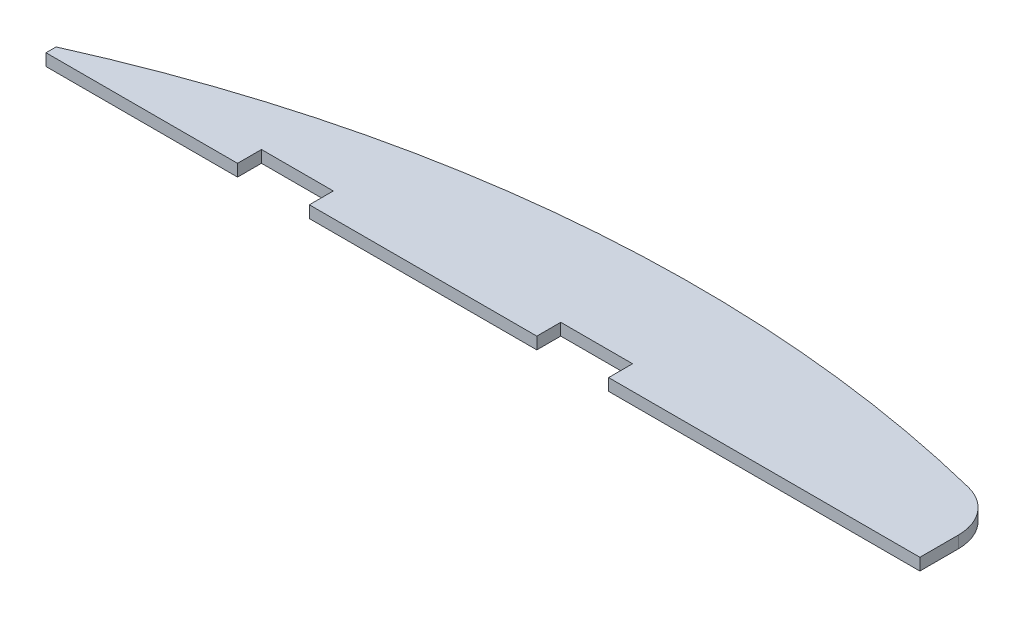
ISO-10303-21;
HEADER;
FILE_DESCRIPTION(('STEP AP214'),'2;1');
FILE_NAME('part.step','',(''),(''),'','','');
FILE_SCHEMA(('AUTOMOTIVE_DESIGN { 1 0 10303 214 1 1 1 1 }'));
ENDSEC;
DATA;
#1=APPLICATION_CONTEXT('core data for automotive mechanical design processes');
#2=APPLICATION_PROTOCOL_DEFINITION('international standard','automotive_design',2000,#1);
#3=PRODUCT_CONTEXT('',#1,'mechanical');
#4=PRODUCT('Part','Part','',(#3));
#5=PRODUCT_RELATED_PRODUCT_CATEGORY('part','',(#4));
#6=PRODUCT_DEFINITION_FORMATION('','',#4);
#7=PRODUCT_DEFINITION_CONTEXT('part definition',#1,'design');
#8=PRODUCT_DEFINITION('design','',#6,#7);
#9=PRODUCT_DEFINITION_SHAPE('','',#8);
#10=(LENGTH_UNIT() NAMED_UNIT(*) SI_UNIT(.MILLI.,.METRE.));
#11=(NAMED_UNIT(*) PLANE_ANGLE_UNIT() SI_UNIT($,.RADIAN.));
#12=(NAMED_UNIT(*) SI_UNIT($,.STERADIAN.) SOLID_ANGLE_UNIT());
#13=UNCERTAINTY_MEASURE_WITH_UNIT(LENGTH_MEASURE(1.E-05),#10,'distance_accuracy_value','');
#14=(GEOMETRIC_REPRESENTATION_CONTEXT(3) GLOBAL_UNCERTAINTY_ASSIGNED_CONTEXT((#13)) GLOBAL_UNIT_ASSIGNED_CONTEXT((#10,
#11,#12)) REPRESENTATION_CONTEXT('',''));
#15=CARTESIAN_POINT('',(0.,0.,0.));
#16=DIRECTION('',(0.,0.,1.));
#17=DIRECTION('',(1.,0.,0.));
#18=AXIS2_PLACEMENT_3D('',#15,#16,#17);
#19=CARTESIAN_POINT('',(-30.,1.,3.));
#20=DIRECTION('',(0.,0.,-1.));
#21=DIRECTION('',(-1.,0.,0.));
#22=AXIS2_PLACEMENT_3D('',#19,#20,#21);
#23=PLANE('',#22);
#24=DIRECTION('',(1.,0.,0.));
#25=VECTOR('',#24,1.);
#26=CARTESIAN_POINT('',(-30.,1.,3.));
#27=LINE('',#26,#25);
#28=CARTESIAN_POINT('',(3.,1.,3.));
#29=VERTEX_POINT('',#28);
#30=CARTESIAN_POINT('',(29.,1.,3.));
#31=VERTEX_POINT('',#30);
#32=EDGE_CURVE('E201',#29,#31,#27,.T.);
#33=ORIENTED_EDGE('',*,*,#32,.F.);
#34=DIRECTION('',(0.,-1.,0.));
#35=VECTOR('',#34,1.);
#36=CARTESIAN_POINT('',(3.,1.,2.99999999999999));
#37=LINE('',#36,#35);
#38=CARTESIAN_POINT('',(3.,0.,3.));
#39=VERTEX_POINT('',#38);
#40=EDGE_CURVE('E193',#29,#39,#37,.T.);
#41=ORIENTED_EDGE('',*,*,#40,.T.);
#42=DIRECTION('',(1.,0.,0.));
#43=VECTOR('',#42,1.);
#44=CARTESIAN_POINT('',(-30.,0.,3.));
#45=LINE('',#44,#43);
#46=CARTESIAN_POINT('',(29.,0.,3.));
#47=VERTEX_POINT('',#46);
#48=EDGE_CURVE('E214',#39,#47,#45,.T.);
#49=ORIENTED_EDGE('',*,*,#48,.T.);
#50=DIRECTION('',(0.,-1.,0.));
#51=VECTOR('',#50,1.);
#52=CARTESIAN_POINT('',(29.,1.,3.));
#53=LINE('',#52,#51);
#54=EDGE_CURVE('E224',#31,#47,#53,.T.);
#55=ORIENTED_EDGE('',*,*,#54,.F.);
#56=EDGE_LOOP('',(#33,#41,#49,#55));
#57=FACE_BOUND('',#56,.T.);
#58=ADVANCED_FACE('F39',(#57),#23,.F.);
#59=CARTESIAN_POINT('',(-22.,0.,3.));
#60=VERTEX_POINT('',#59);
#61=CARTESIAN_POINT('',(-3.,0.,2.99999999999999));
#62=VERTEX_POINT('',#61);
#63=EDGE_CURVE('E218',#60,#62,#45,.T.);
#64=ORIENTED_EDGE('',*,*,#63,.T.);
#65=DIRECTION('',(0.,1.,0.));
#66=VECTOR('',#65,1.);
#67=CARTESIAN_POINT('',(-3.,1.,2.99999999999999));
#68=LINE('',#67,#66);
#69=CARTESIAN_POINT('',(-3.,1.,3.));
#70=VERTEX_POINT('',#69);
#71=EDGE_CURVE('E191',#62,#70,#68,.T.);
#72=ORIENTED_EDGE('',*,*,#71,.T.);
#73=CARTESIAN_POINT('',(-22.,1.,3.));
#74=VERTEX_POINT('',#73);
#75=EDGE_CURVE('E157',#74,#70,#27,.T.);
#76=ORIENTED_EDGE('',*,*,#75,.F.);
#77=DIRECTION('',(0.,-1.,0.));
#78=VECTOR('',#77,1.);
#79=CARTESIAN_POINT('',(-22.,1.,3.));
#80=LINE('',#79,#78);
#81=EDGE_CURVE('E188',#74,#60,#80,.T.);
#82=ORIENTED_EDGE('',*,*,#81,.T.);
#83=EDGE_LOOP('',(#64,#72,#76,#82));
#84=FACE_BOUND('',#83,.T.);
#85=ADVANCED_FACE('F256',(#84),#23,.F.);
#86=CARTESIAN_POINT('',(29.,1.,-3.28601066940285));
#87=DIRECTION('',(-1.,0.,0.));
#88=DIRECTION('',(0.,0.,1.));
#89=AXIS2_PLACEMENT_3D('',#86,#87,#88);
#90=PLANE('',#89);
#91=DIRECTION('',(0.,0.,-1.));
#92=VECTOR('',#91,1.);
#93=CARTESIAN_POINT('',(29.,0.,-3.28601066940285));
#94=LINE('',#93,#92);
#95=CARTESIAN_POINT('',(29.,0.,-0.208582169108796));
#96=VERTEX_POINT('',#95);
#97=EDGE_CURVE('E196',#47,#96,#94,.T.);
#98=ORIENTED_EDGE('',*,*,#97,.T.);
#99=DIRECTION('',(0.,-1.,0.));
#100=VECTOR('',#99,1.);
#101=CARTESIAN_POINT('',(29.,1.,-0.208582169108795));
#102=LINE('',#101,#100);
#103=CARTESIAN_POINT('',(29.,1.,-0.208582169108796));
#104=VERTEX_POINT('',#103);
#105=EDGE_CURVE('E47',#96,#104,#102,.F.);
#106=ORIENTED_EDGE('',*,*,#105,.T.);
#107=DIRECTION('',(0.,0.,-1.));
#108=VECTOR('',#107,1.);
#109=CARTESIAN_POINT('',(29.,1.,-3.28601066940285));
#110=LINE('',#109,#108);
#111=EDGE_CURVE('E200',#31,#104,#110,.T.);
#112=ORIENTED_EDGE('',*,*,#111,.F.);
#113=ORIENTED_EDGE('',*,*,#54,.T.);
#114=EDGE_LOOP('',(#98,#106,#112,#113));
#115=FACE_BOUND('',#114,.T.);
#116=ADVANCED_FACE('F262',(#115),#90,.F.);
#117=CARTESIAN_POINT('',(0.,1.,100.));
#118=DIRECTION('',(0.,-1.,0.));
#119=DIRECTION('',(0.,0.,-1.));
#120=AXIS2_PLACEMENT_3D('',#117,#118,#119);
#121=CYLINDRICAL_SURFACE('',#120,107.280007457121);
#122=CARTESIAN_POINT('',(0.,1.,100.));
#123=DIRECTION('',(0.,1.,0.));
#124=DIRECTION('',(0.,0.,1.));
#125=AXIS2_PLACEMENT_3D('',#122,#123,#124);
#126=CIRCLE('',#125,107.280007457121);
#127=CARTESIAN_POINT('',(25.9682416032117,1.,-4.08962689930839));
#128=VERTEX_POINT('',#127);
#129=CARTESIAN_POINT('',(-44.,1.,2.15829110241379));
#130=VERTEX_POINT('',#129);
#131=EDGE_CURVE('E203',#128,#130,#126,.T.);
#132=ORIENTED_EDGE('',*,*,#131,.F.);
#133=DIRECTION('',(0.,-1.,0.));
#134=VECTOR('',#133,1.);
#135=CARTESIAN_POINT('',(25.9682416032117,1.,-4.0896268993084));
#136=LINE('',#135,#134);
#137=CARTESIAN_POINT('',(25.9682416032117,0.,-4.08962689930839));
#138=VERTEX_POINT('',#137);
#139=EDGE_CURVE('E231',#128,#138,#136,.T.);
#140=ORIENTED_EDGE('',*,*,#139,.T.);
#141=CARTESIAN_POINT('',(0.,0.,100.));
#142=DIRECTION('',(0.,1.,0.));
#143=DIRECTION('',(0.,0.,1.));
#144=AXIS2_PLACEMENT_3D('',#141,#142,#143);
#145=CIRCLE('',#144,107.280007457121);
#146=CARTESIAN_POINT('',(-44.,0.,2.15829110241379));
#147=VERTEX_POINT('',#146);
#148=EDGE_CURVE('E210',#138,#147,#145,.T.);
#149=ORIENTED_EDGE('',*,*,#148,.T.);
#150=DIRECTION('',(0.,-1.,0.));
#151=VECTOR('',#150,1.);
#152=CARTESIAN_POINT('',(-44.,1.,2.15829110241379));
#153=LINE('',#152,#151);
#154=EDGE_CURVE('E221',#130,#147,#153,.T.);
#155=ORIENTED_EDGE('',*,*,#154,.F.);
#156=EDGE_LOOP('',(#132,#140,#149,#155));
#157=FACE_BOUND('',#156,.T.);
#158=ADVANCED_FACE('F237',(#157),#121,.T.);
#159=CARTESIAN_POINT('',(-44.,1.,2.15829110241379));
#160=DIRECTION('',(1.,0.,0.));
#161=DIRECTION('',(0.,0.,-1.));
#162=AXIS2_PLACEMENT_3D('',#159,#160,#161);
#163=PLANE('',#162);
#164=DIRECTION('',(0.,0.,1.));
#165=VECTOR('',#164,1.);
#166=CARTESIAN_POINT('',(-44.,0.,2.15829110241379));
#167=LINE('',#166,#165);
#168=CARTESIAN_POINT('',(-44.,0.,3.));
#169=VERTEX_POINT('',#168);
#170=EDGE_CURVE('E212',#147,#169,#167,.T.);
#171=ORIENTED_EDGE('',*,*,#170,.T.);
#172=DIRECTION('',(0.,-1.,0.));
#173=VECTOR('',#172,1.);
#174=CARTESIAN_POINT('',(-44.,1.,3.));
#175=LINE('',#174,#173);
#176=CARTESIAN_POINT('',(-44.,1.,3.));
#177=VERTEX_POINT('',#176);
#178=EDGE_CURVE('E208',#177,#169,#175,.T.);
#179=ORIENTED_EDGE('',*,*,#178,.F.);
#180=DIRECTION('',(0.,0.,1.));
#181=VECTOR('',#180,1.);
#182=CARTESIAN_POINT('',(-44.,1.,2.15829110241379));
#183=LINE('',#182,#181);
#184=EDGE_CURVE('E205',#130,#177,#183,.T.);
#185=ORIENTED_EDGE('',*,*,#184,.F.);
#186=ORIENTED_EDGE('',*,*,#154,.T.);
#187=EDGE_LOOP('',(#171,#179,#185,#186));
#188=FACE_BOUND('',#187,.T.);
#189=ADVANCED_FACE('F246',(#188),#163,.F.);
#190=CARTESIAN_POINT('',(-28.,0.,3.));
#191=VERTEX_POINT('',#190);
#192=EDGE_CURVE('E215',#169,#191,#45,.T.);
#193=ORIENTED_EDGE('',*,*,#192,.T.);
#194=DIRECTION('',(0.,1.,0.));
#195=VECTOR('',#194,1.);
#196=CARTESIAN_POINT('',(-28.,1.,3.));
#197=LINE('',#196,#195);
#198=CARTESIAN_POINT('',(-28.,1.,3.));
#199=VERTEX_POINT('',#198);
#200=EDGE_CURVE('E167',#191,#199,#197,.T.);
#201=ORIENTED_EDGE('',*,*,#200,.T.);
#202=EDGE_CURVE('E197',#177,#199,#27,.T.);
#203=ORIENTED_EDGE('',*,*,#202,.F.);
#204=ORIENTED_EDGE('',*,*,#178,.T.);
#205=EDGE_LOOP('',(#193,#201,#203,#204));
#206=FACE_BOUND('',#205,.T.);
#207=ADVANCED_FACE('F249',(#206),#23,.F.);
#208=CARTESIAN_POINT('',(0.,1.,100.));
#209=DIRECTION('',(0.,1.,0.));
#210=DIRECTION('',(0.,0.,1.));
#211=AXIS2_PLACEMENT_3D('',#208,#209,#210);
#212=PLANE('',#211);
#213=ORIENTED_EDGE('',*,*,#111,.T.);
#214=CARTESIAN_POINT('',(25.,1.,-0.208582169108795));
#215=DIRECTION('',(0.,1.,0.));
#216=DIRECTION('',(0.,0.,1.));
#217=AXIS2_PLACEMENT_3D('',#214,#215,#216);
#218=CIRCLE('',#217,4.);
#219=EDGE_CURVE('E11',#104,#128,#218,.T.);
#220=ORIENTED_EDGE('',*,*,#219,.T.);
#221=ORIENTED_EDGE('',*,*,#131,.T.);
#222=ORIENTED_EDGE('',*,*,#184,.T.);
#223=ORIENTED_EDGE('',*,*,#202,.T.);
#224=DIRECTION('',(0.,0.,-1.));
#225=VECTOR('',#224,1.);
#226=CARTESIAN_POINT('',(-28.,1.,4.99999999999983));
#227=LINE('',#226,#225);
#228=CARTESIAN_POINT('',(-28.,1.,0.999999999999828));
#229=VERTEX_POINT('',#228);
#230=EDGE_CURVE('E182',#199,#229,#227,.T.);
#231=ORIENTED_EDGE('',*,*,#230,.T.);
#232=DIRECTION('',(1.,0.,0.));
#233=VECTOR('',#232,1.);
#234=CARTESIAN_POINT('',(-28.,1.,0.999999999999828));
#235=LINE('',#234,#233);
#236=CARTESIAN_POINT('',(-22.,1.,0.999999999999828));
#237=VERTEX_POINT('',#236);
#238=EDGE_CURVE('E172',#229,#237,#235,.T.);
#239=ORIENTED_EDGE('',*,*,#238,.T.);
#240=DIRECTION('',(0.,0.,1.));
#241=VECTOR('',#240,1.);
#242=CARTESIAN_POINT('',(-22.,1.,4.99999999999983));
#243=LINE('',#242,#241);
#244=EDGE_CURVE('E178',#237,#74,#243,.T.);
#245=ORIENTED_EDGE('',*,*,#244,.T.);
#246=ORIENTED_EDGE('',*,*,#75,.T.);
#247=DIRECTION('',(0.,0.,-1.));
#248=VECTOR('',#247,1.);
#249=CARTESIAN_POINT('',(-3.,1.,5.));
#250=LINE('',#249,#248);
#251=CARTESIAN_POINT('',(-3.,1.,1.));
#252=VERTEX_POINT('',#251);
#253=EDGE_CURVE('E137',#70,#252,#250,.T.);
#254=ORIENTED_EDGE('',*,*,#253,.T.);
#255=DIRECTION('',(1.,0.,0.));
#256=VECTOR('',#255,1.);
#257=CARTESIAN_POINT('',(-3.,1.,1.));
#258=LINE('',#257,#256);
#259=CARTESIAN_POINT('',(3.,1.,1.));
#260=VERTEX_POINT('',#259);
#261=EDGE_CURVE('E145',#252,#260,#258,.T.);
#262=ORIENTED_EDGE('',*,*,#261,.T.);
#263=DIRECTION('',(0.,0.,1.));
#264=VECTOR('',#263,1.);
#265=CARTESIAN_POINT('',(3.,1.,5.));
#266=LINE('',#265,#264);
#267=EDGE_CURVE('E158',#260,#29,#266,.T.);
#268=ORIENTED_EDGE('',*,*,#267,.T.);
#269=ORIENTED_EDGE('',*,*,#32,.T.);
#270=EDGE_LOOP('',(#213,#220,#221,#222,#223,#231,#239,#245,#246,#254,#262,#268,#269));
#271=FACE_BOUND('',#270,.T.);
#272=ADVANCED_FACE('F154',(#271),#212,.T.);
#273=CARTESIAN_POINT('',(0.,0.,100.));
#274=DIRECTION('',(0.,1.,0.));
#275=DIRECTION('',(0.,0.,1.));
#276=AXIS2_PLACEMENT_3D('',#273,#274,#275);
#277=PLANE('',#276);
#278=ORIENTED_EDGE('',*,*,#148,.F.);
#279=CARTESIAN_POINT('',(25.,0.,-0.208582169108795));
#280=DIRECTION('',(0.,1.,0.));
#281=DIRECTION('',(0.,0.,1.));
#282=AXIS2_PLACEMENT_3D('',#279,#280,#281);
#283=CIRCLE('',#282,4.);
#284=EDGE_CURVE('E61',#138,#96,#283,.F.);
#285=ORIENTED_EDGE('',*,*,#284,.T.);
#286=ORIENTED_EDGE('',*,*,#97,.F.);
#287=ORIENTED_EDGE('',*,*,#48,.F.);
#288=DIRECTION('',(0.,0.,1.));
#289=VECTOR('',#288,1.);
#290=CARTESIAN_POINT('',(3.,0.,5.));
#291=LINE('',#290,#289);
#292=CARTESIAN_POINT('',(3.,0.,1.));
#293=VERTEX_POINT('',#292);
#294=EDGE_CURVE('E163',#293,#39,#291,.T.);
#295=ORIENTED_EDGE('',*,*,#294,.F.);
#296=DIRECTION('',(1.,0.,0.));
#297=VECTOR('',#296,1.);
#298=CARTESIAN_POINT('',(-3.,0.,1.));
#299=LINE('',#298,#297);
#300=CARTESIAN_POINT('',(-3.,0.,1.));
#301=VERTEX_POINT('',#300);
#302=EDGE_CURVE('E160',#301,#293,#299,.T.);
#303=ORIENTED_EDGE('',*,*,#302,.F.);
#304=DIRECTION('',(0.,0.,1.));
#305=VECTOR('',#304,1.);
#306=CARTESIAN_POINT('',(-3.00000000000002,0.,100.));
#307=LINE('',#306,#305);
#308=EDGE_CURVE('E140',#301,#62,#307,.T.);
#309=ORIENTED_EDGE('',*,*,#308,.T.);
#310=ORIENTED_EDGE('',*,*,#63,.F.);
#311=DIRECTION('',(0.,0.,1.));
#312=VECTOR('',#311,1.);
#313=CARTESIAN_POINT('',(-22.,0.,4.99999999999983));
#314=LINE('',#313,#312);
#315=CARTESIAN_POINT('',(-22.,0.,0.999999999999828));
#316=VERTEX_POINT('',#315);
#317=EDGE_CURVE('E165',#316,#60,#314,.T.);
#318=ORIENTED_EDGE('',*,*,#317,.F.);
#319=DIRECTION('',(1.,0.,0.));
#320=VECTOR('',#319,1.);
#321=CARTESIAN_POINT('',(-28.,0.,0.999999999999828));
#322=LINE('',#321,#320);
#323=CARTESIAN_POINT('',(-28.,0.,0.999999999999828));
#324=VERTEX_POINT('',#323);
#325=EDGE_CURVE('E175',#324,#316,#322,.T.);
#326=ORIENTED_EDGE('',*,*,#325,.F.);
#327=DIRECTION('',(0.,0.,1.));
#328=VECTOR('',#327,1.);
#329=CARTESIAN_POINT('',(-28.,0.,100.));
#330=LINE('',#329,#328);
#331=EDGE_CURVE('E227',#324,#191,#330,.T.);
#332=ORIENTED_EDGE('',*,*,#331,.T.);
#333=ORIENTED_EDGE('',*,*,#192,.F.);
#334=ORIENTED_EDGE('',*,*,#170,.F.);
#335=EDGE_LOOP('',(#278,#285,#286,#287,#295,#303,#309,#310,#318,#326,#332,#333,#334));
#336=FACE_BOUND('',#335,.T.);
#337=ADVANCED_FACE('F242',(#336),#277,.F.);
#338=CARTESIAN_POINT('',(-22.,1.,4.99999999999983));
#339=DIRECTION('',(1.,0.,0.));
#340=DIRECTION('',(0.,0.,-1.));
#341=AXIS2_PLACEMENT_3D('',#338,#339,#340);
#342=PLANE('',#341);
#343=ORIENTED_EDGE('',*,*,#244,.F.);
#344=DIRECTION('',(0.,-1.,0.));
#345=VECTOR('',#344,1.);
#346=CARTESIAN_POINT('',(-22.,1.,0.999999999999828));
#347=LINE('',#346,#345);
#348=EDGE_CURVE('E173',#237,#316,#347,.T.);
#349=ORIENTED_EDGE('',*,*,#348,.T.);
#350=ORIENTED_EDGE('',*,*,#317,.T.);
#351=ORIENTED_EDGE('',*,*,#81,.F.);
#352=EDGE_LOOP('',(#343,#349,#350,#351));
#353=FACE_BOUND('',#352,.T.);
#354=ADVANCED_FACE('F289',(#353),#342,.F.);
#355=CARTESIAN_POINT('',(-28.,1.,4.99999999999983));
#356=DIRECTION('',(-1.,0.,0.));
#357=DIRECTION('',(0.,0.,1.));
#358=AXIS2_PLACEMENT_3D('',#355,#356,#357);
#359=PLANE('',#358);
#360=ORIENTED_EDGE('',*,*,#331,.F.);
#361=DIRECTION('',(0.,-1.,0.));
#362=VECTOR('',#361,1.);
#363=CARTESIAN_POINT('',(-28.,1.,0.999999999999828));
#364=LINE('',#363,#362);
#365=EDGE_CURVE('E169',#229,#324,#364,.T.);
#366=ORIENTED_EDGE('',*,*,#365,.F.);
#367=ORIENTED_EDGE('',*,*,#230,.F.);
#368=ORIENTED_EDGE('',*,*,#200,.F.);
#369=EDGE_LOOP('',(#360,#366,#367,#368));
#370=FACE_BOUND('',#369,.T.);
#371=ADVANCED_FACE('F294',(#370),#359,.F.);
#372=CARTESIAN_POINT('',(-28.,1.,0.999999999999828));
#373=DIRECTION('',(0.,0.,-1.));
#374=DIRECTION('',(-1.,0.,0.));
#375=AXIS2_PLACEMENT_3D('',#372,#373,#374);
#376=PLANE('',#375);
#377=ORIENTED_EDGE('',*,*,#325,.T.);
#378=ORIENTED_EDGE('',*,*,#348,.F.);
#379=ORIENTED_EDGE('',*,*,#238,.F.);
#380=ORIENTED_EDGE('',*,*,#365,.T.);
#381=EDGE_LOOP('',(#377,#378,#379,#380));
#382=FACE_BOUND('',#381,.T.);
#383=ADVANCED_FACE('F292',(#382),#376,.F.);
#384=CARTESIAN_POINT('',(3.,1.,5.));
#385=DIRECTION('',(1.,0.,0.));
#386=DIRECTION('',(0.,0.,-1.));
#387=AXIS2_PLACEMENT_3D('',#384,#385,#386);
#388=PLANE('',#387);
#389=ORIENTED_EDGE('',*,*,#267,.F.);
#390=DIRECTION('',(0.,-1.,0.));
#391=VECTOR('',#390,1.);
#392=CARTESIAN_POINT('',(3.,1.,1.));
#393=LINE('',#392,#391);
#394=EDGE_CURVE('E144',#260,#293,#393,.T.);
#395=ORIENTED_EDGE('',*,*,#394,.T.);
#396=ORIENTED_EDGE('',*,*,#294,.T.);
#397=ORIENTED_EDGE('',*,*,#40,.F.);
#398=EDGE_LOOP('',(#389,#395,#396,#397));
#399=FACE_BOUND('',#398,.T.);
#400=ADVANCED_FACE('F296',(#399),#388,.F.);
#401=CARTESIAN_POINT('',(-3.,1.,5.));
#402=DIRECTION('',(-1.,0.,0.));
#403=DIRECTION('',(0.,0.,1.));
#404=AXIS2_PLACEMENT_3D('',#401,#402,#403);
#405=PLANE('',#404);
#406=ORIENTED_EDGE('',*,*,#308,.F.);
#407=DIRECTION('',(0.,-1.,0.));
#408=VECTOR('',#407,1.);
#409=CARTESIAN_POINT('',(-3.,1.,1.));
#410=LINE('',#409,#408);
#411=EDGE_CURVE('E133',#252,#301,#410,.T.);
#412=ORIENTED_EDGE('',*,*,#411,.F.);
#413=ORIENTED_EDGE('',*,*,#253,.F.);
#414=ORIENTED_EDGE('',*,*,#71,.F.);
#415=EDGE_LOOP('',(#406,#412,#413,#414));
#416=FACE_BOUND('',#415,.T.);
#417=ADVANCED_FACE('F135',(#416),#405,.F.);
#418=CARTESIAN_POINT('',(-3.,1.,1.));
#419=DIRECTION('',(0.,0.,-1.));
#420=DIRECTION('',(-1.,0.,0.));
#421=AXIS2_PLACEMENT_3D('',#418,#419,#420);
#422=PLANE('',#421);
#423=ORIENTED_EDGE('',*,*,#302,.T.);
#424=ORIENTED_EDGE('',*,*,#394,.F.);
#425=ORIENTED_EDGE('',*,*,#261,.F.);
#426=ORIENTED_EDGE('',*,*,#411,.T.);
#427=EDGE_LOOP('',(#423,#424,#425,#426));
#428=FACE_BOUND('',#427,.T.);
#429=ADVANCED_FACE('F148',(#428),#422,.F.);
#430=CARTESIAN_POINT('',(25.,1.,-0.208582169108795));
#431=DIRECTION('',(0.,-1.,0.));
#432=DIRECTION('',(0.,0.,-1.));
#433=AXIS2_PLACEMENT_3D('',#430,#431,#432);
#434=CYLINDRICAL_SURFACE('',#433,4.);
#435=ORIENTED_EDGE('',*,*,#219,.F.);
#436=ORIENTED_EDGE('',*,*,#105,.F.);
#437=ORIENTED_EDGE('',*,*,#284,.F.);
#438=ORIENTED_EDGE('',*,*,#139,.F.);
#439=EDGE_LOOP('',(#435,#436,#437,#438));
#440=FACE_BOUND('',#439,.T.);
#441=ADVANCED_FACE('F41',(#440),#434,.T.);
#442=CLOSED_SHELL('',(#58,#85,#116,#158,#189,#207,#272,#337,#354,#371,#383,#400,#417,#429,#441));
#443=MANIFOLD_SOLID_BREP('B2',#442);
#444=ADVANCED_BREP_SHAPE_REPRESENTATION('',(#18,#443),#14);
#445=SHAPE_DEFINITION_REPRESENTATION(#9,#444);
ENDSEC;
END-ISO-10303-21;
